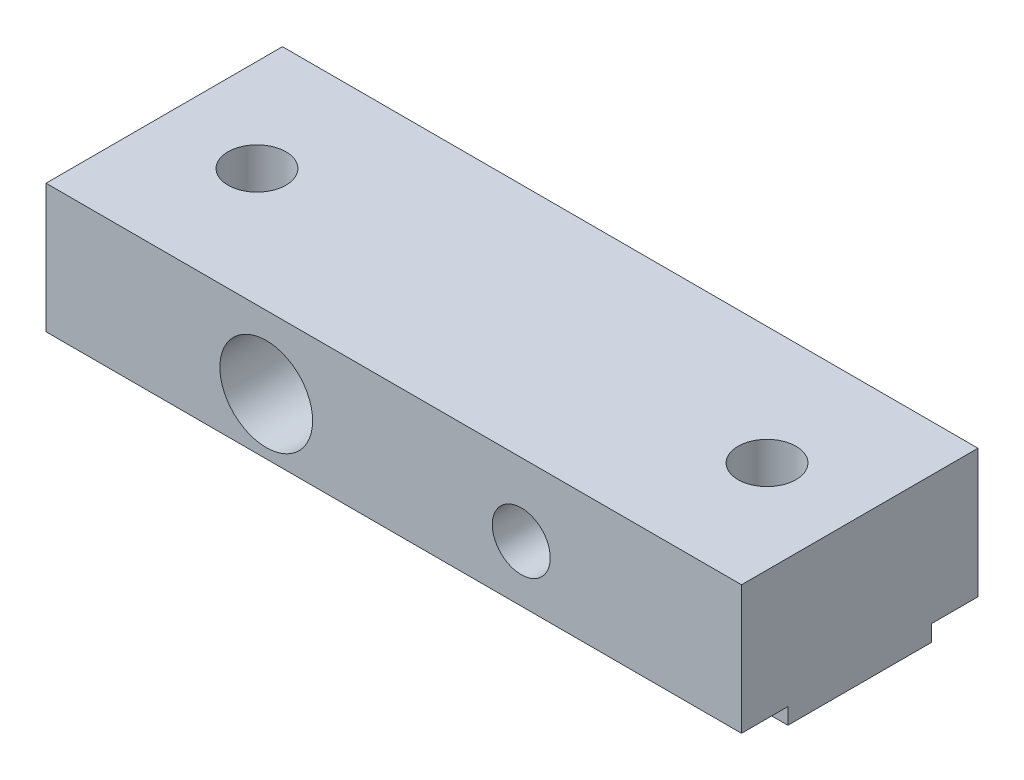
ISO-10303-21;
HEADER;
FILE_DESCRIPTION(('STEP AP214'),'2;1');
FILE_NAME('part.step','',(''),(''),'','','');
FILE_SCHEMA(('AUTOMOTIVE_DESIGN { 1 0 10303 214 1 1 1 1 }'));
ENDSEC;
DATA;
#1=APPLICATION_CONTEXT('core data for automotive mechanical design processes');
#2=APPLICATION_PROTOCOL_DEFINITION('international standard','automotive_design',2000,#1);
#3=PRODUCT_CONTEXT('',#1,'mechanical');
#4=PRODUCT('Part','Part','',(#3));
#5=PRODUCT_RELATED_PRODUCT_CATEGORY('part','',(#4));
#6=PRODUCT_DEFINITION_FORMATION('','',#4);
#7=PRODUCT_DEFINITION_CONTEXT('part definition',#1,'design');
#8=PRODUCT_DEFINITION('design','',#6,#7);
#9=PRODUCT_DEFINITION_SHAPE('','',#8);
#10=(LENGTH_UNIT() NAMED_UNIT(*) SI_UNIT(.MILLI.,.METRE.));
#11=(NAMED_UNIT(*) PLANE_ANGLE_UNIT() SI_UNIT($,.RADIAN.));
#12=(NAMED_UNIT(*) SI_UNIT($,.STERADIAN.) SOLID_ANGLE_UNIT());
#13=UNCERTAINTY_MEASURE_WITH_UNIT(LENGTH_MEASURE(1.E-05),#10,'distance_accuracy_value','');
#14=(GEOMETRIC_REPRESENTATION_CONTEXT(3) GLOBAL_UNCERTAINTY_ASSIGNED_CONTEXT((#13)) GLOBAL_UNIT_ASSIGNED_CONTEXT((#10,
#11,#12)) REPRESENTATION_CONTEXT('',''));
#15=CARTESIAN_POINT('',(0.,0.,0.));
#16=DIRECTION('',(0.,0.,1.));
#17=DIRECTION('',(1.,0.,0.));
#18=AXIS2_PLACEMENT_3D('',#15,#16,#17);
#19=CARTESIAN_POINT('',(0.,6.25,0.));
#20=DIRECTION('',(1.,0.,0.));
#21=DIRECTION('',(0.,0.,-1.));
#22=AXIS2_PLACEMENT_3D('',#19,#20,#21);
#23=PLANE('',#22);
#24=DIRECTION('',(0.,0.,-1.));
#25=VECTOR('',#24,1.);
#26=CARTESIAN_POINT('',(0.,0.7,0.));
#27=LINE('',#26,#25);
#28=CARTESIAN_POINT('',(0.,0.7,0.));
#29=VERTEX_POINT('',#28);
#30=CARTESIAN_POINT('',(0.,0.7,-2.));
#31=VERTEX_POINT('',#30);
#32=EDGE_CURVE('E99',#29,#31,#27,.T.);
#33=ORIENTED_EDGE('',*,*,#32,.F.);
#34=DIRECTION('',(0.,-1.,0.));
#35=VECTOR('',#34,1.);
#36=CARTESIAN_POINT('',(0.,6.25,0.));
#37=LINE('',#36,#35);
#38=CARTESIAN_POINT('',(0.,6.25,0.));
#39=VERTEX_POINT('',#38);
#40=EDGE_CURVE('E11',#39,#29,#37,.T.);
#41=ORIENTED_EDGE('',*,*,#40,.F.);
#42=DIRECTION('',(0.,0.,1.));
#43=VECTOR('',#42,1.);
#44=CARTESIAN_POINT('',(0.,6.25,0.));
#45=LINE('',#44,#43);
#46=CARTESIAN_POINT('',(0.,6.25,-10.2));
#47=VERTEX_POINT('',#46);
#48=EDGE_CURVE('E165',#47,#39,#45,.T.);
#49=ORIENTED_EDGE('',*,*,#48,.F.);
#50=DIRECTION('',(0.,-1.,0.));
#51=VECTOR('',#50,1.);
#52=CARTESIAN_POINT('',(0.,6.25,-10.2));
#53=LINE('',#52,#51);
#54=CARTESIAN_POINT('',(0.,0.7,-10.2));
#55=VERTEX_POINT('',#54);
#56=EDGE_CURVE('E174',#47,#55,#53,.T.);
#57=ORIENTED_EDGE('',*,*,#56,.T.);
#58=DIRECTION('',(0.,0.,1.));
#59=VECTOR('',#58,1.);
#60=CARTESIAN_POINT('',(0.,0.7,-10.2));
#61=LINE('',#60,#59);
#62=CARTESIAN_POINT('',(0.,0.7,-8.2));
#63=VERTEX_POINT('',#62);
#64=EDGE_CURVE('E125',#55,#63,#61,.T.);
#65=ORIENTED_EDGE('',*,*,#64,.T.);
#66=DIRECTION('',(0.,-1.,0.));
#67=VECTOR('',#66,1.);
#68=CARTESIAN_POINT('',(0.,0.,-8.2));
#69=LINE('',#68,#67);
#70=CARTESIAN_POINT('',(0.,0.,-8.2));
#71=VERTEX_POINT('',#70);
#72=EDGE_CURVE('E128',#63,#71,#69,.T.);
#73=ORIENTED_EDGE('',*,*,#72,.T.);
#74=DIRECTION('',(0.,0.,1.));
#75=VECTOR('',#74,1.);
#76=CARTESIAN_POINT('',(0.,0.,0.));
#77=LINE('',#76,#75);
#78=CARTESIAN_POINT('',(0.,0.,-2.));
#79=VERTEX_POINT('',#78);
#80=EDGE_CURVE('E116',#71,#79,#77,.T.);
#81=ORIENTED_EDGE('',*,*,#80,.T.);
#82=DIRECTION('',(0.,-1.,0.));
#83=VECTOR('',#82,1.);
#84=CARTESIAN_POINT('',(0.,0.,-2.));
#85=LINE('',#84,#83);
#86=EDGE_CURVE('E47',#31,#79,#85,.T.);
#87=ORIENTED_EDGE('',*,*,#86,.F.);
#88=EDGE_LOOP('',(#33,#41,#49,#57,#65,#73,#81,#87));
#89=FACE_BOUND('',#88,.T.);
#90=ADVANCED_FACE('F33',(#89),#23,.F.);
#91=CARTESIAN_POINT('',(0.,6.25,0.));
#92=DIRECTION('',(0.,0.,-1.));
#93=DIRECTION('',(-1.,0.,0.));
#94=AXIS2_PLACEMENT_3D('',#91,#92,#93);
#95=PLANE('',#94);
#96=CARTESIAN_POINT('',(9.5,3.125,0.));
#97=DIRECTION('',(0.,0.,1.));
#98=DIRECTION('',(1.,0.,0.));
#99=AXIS2_PLACEMENT_3D('',#96,#97,#98);
#100=CIRCLE('',#99,2.);
#101=CARTESIAN_POINT('',(11.5,3.125,0.));
#102=VERTEX_POINT('',#101);
#103=EDGE_CURVE('E159',#102,#102,#100,.T.);
#104=ORIENTED_EDGE('',*,*,#103,.F.);
#105=EDGE_LOOP('',(#104));
#106=FACE_BOUND('',#105,.T.);
#107=CARTESIAN_POINT('',(20.5,3.125,0.));
#108=DIRECTION('',(0.,0.,1.));
#109=DIRECTION('',(1.,0.,0.));
#110=AXIS2_PLACEMENT_3D('',#107,#108,#109);
#111=CIRCLE('',#110,1.24999999999999);
#112=CARTESIAN_POINT('',(21.75,3.125,0.));
#113=VERTEX_POINT('',#112);
#114=EDGE_CURVE('E153',#113,#113,#111,.T.);
#115=ORIENTED_EDGE('',*,*,#114,.F.);
#116=EDGE_LOOP('',(#115));
#117=FACE_BOUND('',#116,.T.);
#118=DIRECTION('',(1.,0.,0.));
#119=VECTOR('',#118,1.);
#120=CARTESIAN_POINT('',(0.,0.7,0.));
#121=LINE('',#120,#119);
#122=CARTESIAN_POINT('',(30.,0.7,0.));
#123=VERTEX_POINT('',#122);
#124=EDGE_CURVE('E104',#29,#123,#121,.T.);
#125=ORIENTED_EDGE('',*,*,#124,.T.);
#126=DIRECTION('',(0.,-1.,0.));
#127=VECTOR('',#126,1.);
#128=CARTESIAN_POINT('',(30.,6.25,0.));
#129=LINE('',#128,#127);
#130=CARTESIAN_POINT('',(30.,6.25,0.));
#131=VERTEX_POINT('',#130);
#132=EDGE_CURVE('E40',#131,#123,#129,.T.);
#133=ORIENTED_EDGE('',*,*,#132,.F.);
#134=DIRECTION('',(1.,0.,0.));
#135=VECTOR('',#134,1.);
#136=CARTESIAN_POINT('',(0.,6.25,0.));
#137=LINE('',#136,#135);
#138=EDGE_CURVE('E168',#39,#131,#137,.T.);
#139=ORIENTED_EDGE('',*,*,#138,.F.);
#140=ORIENTED_EDGE('',*,*,#40,.T.);
#141=EDGE_LOOP('',(#125,#133,#139,#140));
#142=FACE_BOUND('',#141,.T.);
#143=ADVANCED_FACE('F187',(#106,#117,#142),#95,.F.);
#144=CARTESIAN_POINT('',(30.,6.25,0.));
#145=DIRECTION('',(-1.,0.,0.));
#146=DIRECTION('',(0.,0.,1.));
#147=AXIS2_PLACEMENT_3D('',#144,#145,#146);
#148=PLANE('',#147);
#149=DIRECTION('',(0.,0.,-1.));
#150=VECTOR('',#149,1.);
#151=CARTESIAN_POINT('',(30.,0.7,0.));
#152=LINE('',#151,#150);
#153=CARTESIAN_POINT('',(30.,0.7,-2.));
#154=VERTEX_POINT('',#153);
#155=EDGE_CURVE('E117',#123,#154,#152,.T.);
#156=ORIENTED_EDGE('',*,*,#155,.T.);
#157=DIRECTION('',(0.,-1.,0.));
#158=VECTOR('',#157,1.);
#159=CARTESIAN_POINT('',(30.,0.,-2.));
#160=LINE('',#159,#158);
#161=CARTESIAN_POINT('',(30.,0.,-2.));
#162=VERTEX_POINT('',#161);
#163=EDGE_CURVE('E110',#154,#162,#160,.T.);
#164=ORIENTED_EDGE('',*,*,#163,.T.);
#165=DIRECTION('',(0.,0.,-1.));
#166=VECTOR('',#165,1.);
#167=CARTESIAN_POINT('',(30.,0.,0.));
#168=LINE('',#167,#166);
#169=CARTESIAN_POINT('',(30.,0.,-8.2));
#170=VERTEX_POINT('',#169);
#171=EDGE_CURVE('E55',#162,#170,#168,.T.);
#172=ORIENTED_EDGE('',*,*,#171,.T.);
#173=DIRECTION('',(0.,-1.,0.));
#174=VECTOR('',#173,1.);
#175=CARTESIAN_POINT('',(30.,0.,-8.2));
#176=LINE('',#175,#174);
#177=CARTESIAN_POINT('',(30.,0.7,-8.2));
#178=VERTEX_POINT('',#177);
#179=EDGE_CURVE('E129',#178,#170,#176,.T.);
#180=ORIENTED_EDGE('',*,*,#179,.F.);
#181=DIRECTION('',(0.,0.,1.));
#182=VECTOR('',#181,1.);
#183=CARTESIAN_POINT('',(30.,0.7,-10.2));
#184=LINE('',#183,#182);
#185=CARTESIAN_POINT('',(30.,0.7,-10.2));
#186=VERTEX_POINT('',#185);
#187=EDGE_CURVE('E122',#186,#178,#184,.T.);
#188=ORIENTED_EDGE('',*,*,#187,.F.);
#189=DIRECTION('',(0.,-1.,0.));
#190=VECTOR('',#189,1.);
#191=CARTESIAN_POINT('',(30.,6.25,-10.2));
#192=LINE('',#191,#190);
#193=CARTESIAN_POINT('',(30.,6.25,-10.2));
#194=VERTEX_POINT('',#193);
#195=EDGE_CURVE('E179',#194,#186,#192,.T.);
#196=ORIENTED_EDGE('',*,*,#195,.F.);
#197=DIRECTION('',(0.,0.,-1.));
#198=VECTOR('',#197,1.);
#199=CARTESIAN_POINT('',(30.,6.25,0.));
#200=LINE('',#199,#198);
#201=EDGE_CURVE('E170',#131,#194,#200,.T.);
#202=ORIENTED_EDGE('',*,*,#201,.F.);
#203=ORIENTED_EDGE('',*,*,#132,.T.);
#204=EDGE_LOOP('',(#156,#164,#172,#180,#188,#196,#202,#203));
#205=FACE_BOUND('',#204,.T.);
#206=ADVANCED_FACE('F184',(#205),#148,.F.);
#207=CARTESIAN_POINT('',(0.,0.,-10.2));
#208=DIRECTION('',(0.,-1.,0.));
#209=DIRECTION('',(0.,0.,-1.));
#210=AXIS2_PLACEMENT_3D('',#207,#208,#209);
#211=PLANE('',#210);
#212=CARTESIAN_POINT('',(26.,0.,-5.1));
#213=DIRECTION('',(0.,1.,0.));
#214=DIRECTION('',(0.,0.,1.));
#215=AXIS2_PLACEMENT_3D('',#212,#213,#214);
#216=CIRCLE('',#215,1.25);
#217=CARTESIAN_POINT('',(26.,0.,-3.85));
#218=VERTEX_POINT('',#217);
#219=EDGE_CURVE('E150',#218,#218,#216,.T.);
#220=ORIENTED_EDGE('',*,*,#219,.T.);
#221=EDGE_LOOP('',(#220));
#222=FACE_BOUND('',#221,.T.);
#223=CARTESIAN_POINT('',(4.,0.,-5.1));
#224=DIRECTION('',(0.,1.,0.));
#225=DIRECTION('',(0.,0.,1.));
#226=AXIS2_PLACEMENT_3D('',#223,#224,#225);
#227=CIRCLE('',#226,1.25);
#228=CARTESIAN_POINT('',(4.,0.,-3.85));
#229=VERTEX_POINT('',#228);
#230=EDGE_CURVE('E144',#229,#229,#227,.T.);
#231=ORIENTED_EDGE('',*,*,#230,.T.);
#232=EDGE_LOOP('',(#231));
#233=FACE_BOUND('',#232,.T.);
#234=ORIENTED_EDGE('',*,*,#171,.F.);
#235=DIRECTION('',(1.,0.,0.));
#236=VECTOR('',#235,1.);
#237=CARTESIAN_POINT('',(0.,0.,-2.));
#238=LINE('',#237,#236);
#239=EDGE_CURVE('E107',#79,#162,#238,.T.);
#240=ORIENTED_EDGE('',*,*,#239,.F.);
#241=ORIENTED_EDGE('',*,*,#80,.F.);
#242=DIRECTION('',(1.,0.,0.));
#243=VECTOR('',#242,1.);
#244=CARTESIAN_POINT('',(0.,0.,-8.2));
#245=LINE('',#244,#243);
#246=EDGE_CURVE('E135',#71,#170,#245,.T.);
#247=ORIENTED_EDGE('',*,*,#246,.T.);
#248=EDGE_LOOP('',(#234,#240,#241,#247));
#249=FACE_BOUND('',#248,.T.);
#250=ADVANCED_FACE('F203',(#222,#233,#249),#211,.T.);
#251=CARTESIAN_POINT('',(0.,6.25,-10.2));
#252=DIRECTION('',(0.,0.,1.));
#253=DIRECTION('',(1.,0.,0.));
#254=AXIS2_PLACEMENT_3D('',#251,#252,#253);
#255=PLANE('',#254);
#256=CARTESIAN_POINT('',(20.5,3.125,-10.2));
#257=DIRECTION('',(0.,0.,1.));
#258=DIRECTION('',(1.,0.,0.));
#259=AXIS2_PLACEMENT_3D('',#256,#257,#258);
#260=CIRCLE('',#259,1.25);
#261=CARTESIAN_POINT('',(21.75,3.125,-10.2));
#262=VERTEX_POINT('',#261);
#263=EDGE_CURVE('E156',#262,#262,#260,.T.);
#264=ORIENTED_EDGE('',*,*,#263,.T.);
#265=EDGE_LOOP('',(#264));
#266=FACE_BOUND('',#265,.T.);
#267=CARTESIAN_POINT('',(9.5,3.125,-10.2));
#268=DIRECTION('',(0.,0.,1.));
#269=DIRECTION('',(1.,0.,0.));
#270=AXIS2_PLACEMENT_3D('',#267,#268,#269);
#271=CIRCLE('',#270,2.);
#272=CARTESIAN_POINT('',(11.5,3.125,-10.2));
#273=VERTEX_POINT('',#272);
#274=EDGE_CURVE('E162',#273,#273,#271,.T.);
#275=ORIENTED_EDGE('',*,*,#274,.T.);
#276=EDGE_LOOP('',(#275));
#277=FACE_BOUND('',#276,.T.);
#278=ORIENTED_EDGE('',*,*,#195,.T.);
#279=DIRECTION('',(1.,0.,0.));
#280=VECTOR('',#279,1.);
#281=CARTESIAN_POINT('',(0.,0.7,-10.2));
#282=LINE('',#281,#280);
#283=EDGE_CURVE('E131',#55,#186,#282,.T.);
#284=ORIENTED_EDGE('',*,*,#283,.F.);
#285=ORIENTED_EDGE('',*,*,#56,.F.);
#286=DIRECTION('',(-1.,0.,0.));
#287=VECTOR('',#286,1.);
#288=CARTESIAN_POINT('',(0.,6.25,-10.2));
#289=LINE('',#288,#287);
#290=EDGE_CURVE('E172',#194,#47,#289,.T.);
#291=ORIENTED_EDGE('',*,*,#290,.F.);
#292=EDGE_LOOP('',(#278,#284,#285,#291));
#293=FACE_BOUND('',#292,.T.);
#294=ADVANCED_FACE('F195',(#266,#277,#293),#255,.F.);
#295=CARTESIAN_POINT('',(0.,6.25,-10.2));
#296=DIRECTION('',(0.,-1.,0.));
#297=DIRECTION('',(0.,0.,-1.));
#298=AXIS2_PLACEMENT_3D('',#295,#296,#297);
#299=PLANE('',#298);
#300=CARTESIAN_POINT('',(4.,6.25,-5.1));
#301=DIRECTION('',(0.,1.,0.));
#302=DIRECTION('',(0.,0.,1.));
#303=AXIS2_PLACEMENT_3D('',#300,#301,#302);
#304=CIRCLE('',#303,1.24999999999999);
#305=CARTESIAN_POINT('',(4.,6.25,-3.85000000000001));
#306=VERTEX_POINT('',#305);
#307=EDGE_CURVE('E138',#306,#306,#304,.T.);
#308=ORIENTED_EDGE('',*,*,#307,.F.);
#309=EDGE_LOOP('',(#308));
#310=FACE_BOUND('',#309,.T.);
#311=CARTESIAN_POINT('',(26.,6.25,-5.1));
#312=DIRECTION('',(0.,1.,0.));
#313=DIRECTION('',(0.,0.,1.));
#314=AXIS2_PLACEMENT_3D('',#311,#312,#313);
#315=CIRCLE('',#314,1.24999999999999);
#316=CARTESIAN_POINT('',(26.,6.25,-3.85000000000001));
#317=VERTEX_POINT('',#316);
#318=EDGE_CURVE('E147',#317,#317,#315,.T.);
#319=ORIENTED_EDGE('',*,*,#318,.F.);
#320=EDGE_LOOP('',(#319));
#321=FACE_BOUND('',#320,.T.);
#322=ORIENTED_EDGE('',*,*,#48,.T.);
#323=ORIENTED_EDGE('',*,*,#138,.T.);
#324=ORIENTED_EDGE('',*,*,#201,.T.);
#325=ORIENTED_EDGE('',*,*,#290,.T.);
#326=EDGE_LOOP('',(#322,#323,#324,#325));
#327=FACE_BOUND('',#326,.T.);
#328=ADVANCED_FACE('F191',(#310,#321,#327),#299,.F.);
#329=CARTESIAN_POINT('',(9.5,3.125,0.));
#330=DIRECTION('',(0.,0.,1.));
#331=DIRECTION('',(1.,0.,0.));
#332=AXIS2_PLACEMENT_3D('',#329,#330,#331);
#333=CYLINDRICAL_SURFACE('',#332,2.);
#334=ORIENTED_EDGE('',*,*,#274,.F.);
#335=EDGE_LOOP('',(#334));
#336=FACE_BOUND('',#335,.T.);
#337=ORIENTED_EDGE('',*,*,#103,.T.);
#338=EDGE_LOOP('',(#337));
#339=FACE_BOUND('',#338,.T.);
#340=ADVANCED_FACE('F230',(#336,#339),#333,.F.);
#341=CARTESIAN_POINT('',(20.5,3.125,0.));
#342=DIRECTION('',(0.,0.,1.));
#343=DIRECTION('',(1.,0.,0.));
#344=AXIS2_PLACEMENT_3D('',#341,#342,#343);
#345=CYLINDRICAL_SURFACE('',#344,1.24999999999999);
#346=ORIENTED_EDGE('',*,*,#263,.F.);
#347=EDGE_LOOP('',(#346));
#348=FACE_BOUND('',#347,.T.);
#349=ORIENTED_EDGE('',*,*,#114,.T.);
#350=EDGE_LOOP('',(#349));
#351=FACE_BOUND('',#350,.T.);
#352=ADVANCED_FACE('F227',(#348,#351),#345,.F.);
#353=CARTESIAN_POINT('',(26.,6.25,-5.1));
#354=DIRECTION('',(0.,1.,0.));
#355=DIRECTION('',(0.,0.,1.));
#356=AXIS2_PLACEMENT_3D('',#353,#354,#355);
#357=CYLINDRICAL_SURFACE('',#356,1.24999999999999);
#358=ORIENTED_EDGE('',*,*,#219,.F.);
#359=EDGE_LOOP('',(#358));
#360=FACE_BOUND('',#359,.T.);
#361=ORIENTED_EDGE('',*,*,#318,.T.);
#362=EDGE_LOOP('',(#361));
#363=FACE_BOUND('',#362,.T.);
#364=ADVANCED_FACE('F229',(#360,#363),#357,.F.);
#365=CARTESIAN_POINT('',(4.,6.25,-5.1));
#366=DIRECTION('',(0.,1.,0.));
#367=DIRECTION('',(0.,0.,1.));
#368=AXIS2_PLACEMENT_3D('',#365,#366,#367);
#369=CYLINDRICAL_SURFACE('',#368,1.24999999999999);
#370=ORIENTED_EDGE('',*,*,#230,.F.);
#371=EDGE_LOOP('',(#370));
#372=FACE_BOUND('',#371,.T.);
#373=ORIENTED_EDGE('',*,*,#307,.T.);
#374=EDGE_LOOP('',(#373));
#375=FACE_BOUND('',#374,.T.);
#376=ADVANCED_FACE('F237',(#372,#375),#369,.F.);
#377=CARTESIAN_POINT('',(0.,0.,-8.2));
#378=DIRECTION('',(0.,0.,1.));
#379=DIRECTION('',(1.,0.,0.));
#380=AXIS2_PLACEMENT_3D('',#377,#378,#379);
#381=PLANE('',#380);
#382=ORIENTED_EDGE('',*,*,#179,.T.);
#383=ORIENTED_EDGE('',*,*,#246,.F.);
#384=ORIENTED_EDGE('',*,*,#72,.F.);
#385=DIRECTION('',(1.,0.,0.));
#386=VECTOR('',#385,1.);
#387=CARTESIAN_POINT('',(0.,0.7,-8.2));
#388=LINE('',#387,#386);
#389=EDGE_CURVE('E139',#63,#178,#388,.T.);
#390=ORIENTED_EDGE('',*,*,#389,.T.);
#391=EDGE_LOOP('',(#382,#383,#384,#390));
#392=FACE_BOUND('',#391,.T.);
#393=ADVANCED_FACE('F200',(#392),#381,.F.);
#394=CARTESIAN_POINT('',(0.,0.7,-10.2));
#395=DIRECTION('',(0.,1.,0.));
#396=DIRECTION('',(0.,0.,1.));
#397=AXIS2_PLACEMENT_3D('',#394,#395,#396);
#398=PLANE('',#397);
#399=ORIENTED_EDGE('',*,*,#187,.T.);
#400=ORIENTED_EDGE('',*,*,#389,.F.);
#401=ORIENTED_EDGE('',*,*,#64,.F.);
#402=ORIENTED_EDGE('',*,*,#283,.T.);
#403=EDGE_LOOP('',(#399,#400,#401,#402));
#404=FACE_BOUND('',#403,.T.);
#405=ADVANCED_FACE('F198',(#404),#398,.F.);
#406=CARTESIAN_POINT('',(0.,0.7,0.));
#407=DIRECTION('',(0.,-1.,0.));
#408=DIRECTION('',(0.,0.,-1.));
#409=AXIS2_PLACEMENT_3D('',#406,#407,#408);
#410=PLANE('',#409);
#411=ORIENTED_EDGE('',*,*,#155,.F.);
#412=ORIENTED_EDGE('',*,*,#124,.F.);
#413=ORIENTED_EDGE('',*,*,#32,.T.);
#414=DIRECTION('',(1.,0.,0.));
#415=VECTOR('',#414,1.);
#416=CARTESIAN_POINT('',(0.,0.7,-2.));
#417=LINE('',#416,#415);
#418=EDGE_CURVE('E101',#31,#154,#417,.T.);
#419=ORIENTED_EDGE('',*,*,#418,.T.);
#420=EDGE_LOOP('',(#411,#412,#413,#419));
#421=FACE_BOUND('',#420,.T.);
#422=ADVANCED_FACE('F100',(#421),#410,.T.);
#423=CARTESIAN_POINT('',(0.,0.,-2.));
#424=DIRECTION('',(0.,0.,1.));
#425=DIRECTION('',(1.,0.,0.));
#426=AXIS2_PLACEMENT_3D('',#423,#424,#425);
#427=PLANE('',#426);
#428=ORIENTED_EDGE('',*,*,#163,.F.);
#429=ORIENTED_EDGE('',*,*,#418,.F.);
#430=ORIENTED_EDGE('',*,*,#86,.T.);
#431=ORIENTED_EDGE('',*,*,#239,.T.);
#432=EDGE_LOOP('',(#428,#429,#430,#431));
#433=FACE_BOUND('',#432,.T.);
#434=ADVANCED_FACE('F109',(#433),#427,.T.);
#435=CLOSED_SHELL('',(#90,#143,#206,#250,#294,#328,#340,#352,#364,#376,#393,#405,#422,#434));
#436=MANIFOLD_SOLID_BREP('B2',#435);
#437=ADVANCED_BREP_SHAPE_REPRESENTATION('',(#18,#436),#14);
#438=SHAPE_DEFINITION_REPRESENTATION(#9,#437);
ENDSEC;
END-ISO-10303-21;
